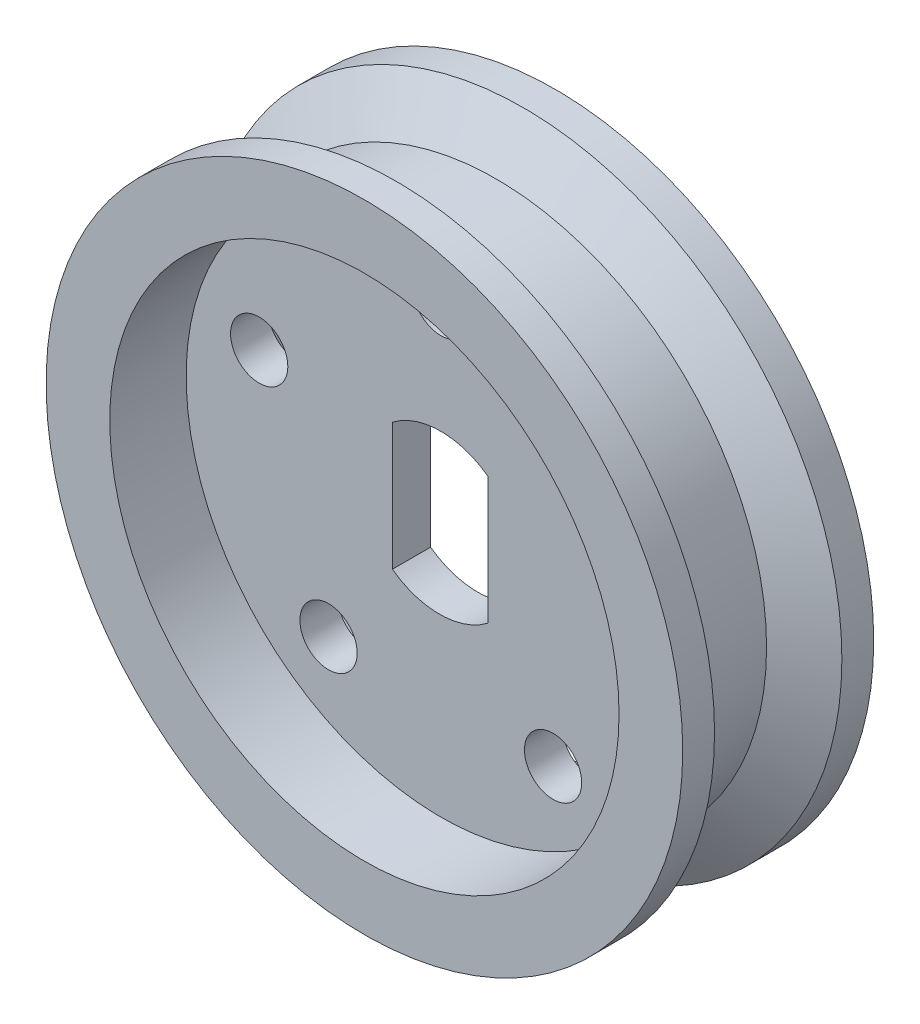
ISO-10303-21;
HEADER;
FILE_DESCRIPTION(('STEP AP214'),'2;1');
FILE_NAME('part.step','',(''),(''),'','','');
FILE_SCHEMA(('AUTOMOTIVE_DESIGN { 1 0 10303 214 1 1 1 1 }'));
ENDSEC;
DATA;
#1=APPLICATION_CONTEXT('core data for automotive mechanical design processes');
#2=APPLICATION_PROTOCOL_DEFINITION('international standard','automotive_design',2000,#1);
#3=PRODUCT_CONTEXT('',#1,'mechanical');
#4=PRODUCT('Part','Part','',(#3));
#5=PRODUCT_RELATED_PRODUCT_CATEGORY('part','',(#4));
#6=PRODUCT_DEFINITION_FORMATION('','',#4);
#7=PRODUCT_DEFINITION_CONTEXT('part definition',#1,'design');
#8=PRODUCT_DEFINITION('design','',#6,#7);
#9=PRODUCT_DEFINITION_SHAPE('','',#8);
#10=(LENGTH_UNIT() NAMED_UNIT(*) SI_UNIT(.MILLI.,.METRE.));
#11=(NAMED_UNIT(*) PLANE_ANGLE_UNIT() SI_UNIT($,.RADIAN.));
#12=(NAMED_UNIT(*) SI_UNIT($,.STERADIAN.) SOLID_ANGLE_UNIT());
#13=UNCERTAINTY_MEASURE_WITH_UNIT(LENGTH_MEASURE(1.E-05),#10,'distance_accuracy_value','');
#14=(GEOMETRIC_REPRESENTATION_CONTEXT(3) GLOBAL_UNCERTAINTY_ASSIGNED_CONTEXT((#13)) GLOBAL_UNIT_ASSIGNED_CONTEXT((#10,
#11,#12)) REPRESENTATION_CONTEXT('',''));
#15=CARTESIAN_POINT('',(0.,0.,0.));
#16=DIRECTION('',(0.,0.,1.));
#17=DIRECTION('',(1.,0.,0.));
#18=AXIS2_PLACEMENT_3D('',#15,#16,#17);
#19=CARTESIAN_POINT('',(0.,0.,3.));
#20=DIRECTION('',(0.,0.,-1.));
#21=DIRECTION('',(-1.,0.,0.));
#22=AXIS2_PLACEMENT_3D('',#19,#20,#21);
#23=CYLINDRICAL_SURFACE('',#22,10.);
#24=CARTESIAN_POINT('',(0.,0.,-3.));
#25=DIRECTION('',(0.,0.,1.));
#26=DIRECTION('',(1.,0.,0.));
#27=AXIS2_PLACEMENT_3D('',#24,#25,#26);
#28=CIRCLE('',#27,10.);
#29=CARTESIAN_POINT('',(10.,0.,-3.));
#30=VERTEX_POINT('',#29);
#31=EDGE_CURVE('E115',#30,#30,#28,.T.);
#32=ORIENTED_EDGE('',*,*,#31,.T.);
#33=EDGE_LOOP('',(#32));
#34=FACE_BOUND('',#33,.T.);
#35=CARTESIAN_POINT('',(0.,0.,-2.));
#36=DIRECTION('',(0.,0.,1.));
#37=DIRECTION('',(1.,0.,0.));
#38=AXIS2_PLACEMENT_3D('',#35,#36,#37);
#39=CIRCLE('',#38,10.);
#40=CARTESIAN_POINT('',(10.,0.,-2.));
#41=VERTEX_POINT('',#40);
#42=EDGE_CURVE('E163',#41,#41,#39,.T.);
#43=ORIENTED_EDGE('',*,*,#42,.F.);
#44=EDGE_LOOP('',(#43));
#45=FACE_BOUND('',#44,.T.);
#46=ADVANCED_FACE('F39',(#34,#45),#23,.T.);
#47=CARTESIAN_POINT('',(0.,0.,3.));
#48=DIRECTION('',(0.,0.,1.));
#49=DIRECTION('',(1.,0.,0.));
#50=AXIS2_PLACEMENT_3D('',#47,#48,#49);
#51=CIRCLE('',#50,10.);
#52=CARTESIAN_POINT('',(10.,0.,3.));
#53=VERTEX_POINT('',#52);
#54=EDGE_CURVE('E116',#53,#53,#51,.T.);
#55=ORIENTED_EDGE('',*,*,#54,.F.);
#56=EDGE_LOOP('',(#55));
#57=FACE_BOUND('',#56,.T.);
#58=CARTESIAN_POINT('',(0.,0.,2.));
#59=DIRECTION('',(0.,0.,1.));
#60=DIRECTION('',(1.,0.,0.));
#61=AXIS2_PLACEMENT_3D('',#58,#59,#60);
#62=CIRCLE('',#61,10.);
#63=CARTESIAN_POINT('',(10.,0.,2.));
#64=VERTEX_POINT('',#63);
#65=EDGE_CURVE('E144',#64,#64,#62,.T.);
#66=ORIENTED_EDGE('',*,*,#65,.T.);
#67=EDGE_LOOP('',(#66));
#68=FACE_BOUND('',#67,.T.);
#69=ADVANCED_FACE('F217',(#57,#68),#23,.T.);
#70=CARTESIAN_POINT('',(-0.0433210245197385,-0.000234595775072503,3.));
#71=DIRECTION('',(0.,0.,-1.));
#72=DIRECTION('',(-1.,0.,0.));
#73=AXIS2_PLACEMENT_3D('',#70,#71,#72);
#74=CYLINDRICAL_SURFACE('',#73,2.5);
#75=DIRECTION('',(0.,0.,-1.));
#76=VECTOR('',#75,1.);
#77=CARTESIAN_POINT('',(1.47825151432448,-1.98387191369263,3.));
#78=LINE('',#77,#76);
#79=CARTESIAN_POINT('',(1.47825151432448,-1.98387191369263,0.6));
#80=VERTEX_POINT('',#79);
#81=CARTESIAN_POINT('',(1.47825151432448,-1.98387191369263,-0.6));
#82=VERTEX_POINT('',#81);
#83=EDGE_CURVE('E93',#80,#82,#78,.T.);
#84=ORIENTED_EDGE('',*,*,#83,.T.);
#85=CARTESIAN_POINT('',(-0.0433210245197385,-0.000234595775072503,-0.6));
#86=DIRECTION('',(0.,0.,-1.));
#87=DIRECTION('',(-1.,0.,0.));
#88=AXIS2_PLACEMENT_3D('',#85,#86,#87);
#89=CIRCLE('',#88,2.5);
#90=CARTESIAN_POINT('',(-1.52157253884421,-2.01636268208244,-0.6));
#91=VERTEX_POINT('',#90);
#92=EDGE_CURVE('E81',#82,#91,#89,.T.);
#93=ORIENTED_EDGE('',*,*,#92,.T.);
#94=DIRECTION('',(0.,0.,-1.));
#95=VECTOR('',#94,1.);
#96=CARTESIAN_POINT('',(-1.52157253884421,-2.01636268208244,3.));
#97=LINE('',#96,#95);
#98=CARTESIAN_POINT('',(-1.52157253884421,-2.01636268208244,0.6));
#99=VERTEX_POINT('',#98);
#100=EDGE_CURVE('E91',#99,#91,#97,.T.);
#101=ORIENTED_EDGE('',*,*,#100,.F.);
#102=CARTESIAN_POINT('',(-0.0433210245197385,-0.000234595775072503,0.6));
#103=DIRECTION('',(0.,0.,1.));
#104=DIRECTION('',(1.,0.,0.));
#105=AXIS2_PLACEMENT_3D('',#102,#103,#104);
#106=CIRCLE('',#105,2.5);
#107=EDGE_CURVE('E63',#99,#80,#106,.T.);
#108=ORIENTED_EDGE('',*,*,#107,.T.);
#109=EDGE_LOOP('',(#84,#93,#101,#108));
#110=FACE_BOUND('',#109,.T.);
#111=ADVANCED_FACE('F90',(#110),#74,.F.);
#112=CARTESIAN_POINT('',(1.47825151432448,2.01612808630737,3.));
#113=DIRECTION('',(-1.,0.,0.));
#114=DIRECTION('',(0.,-1.,0.));
#115=AXIS2_PLACEMENT_3D('',#112,#113,#114);
#116=PLANE('',#115);
#117=DIRECTION('',(0.,0.,-1.));
#118=VECTOR('',#117,1.);
#119=CARTESIAN_POINT('',(1.47825151432448,2.01612808630737,3.));
#120=LINE('',#119,#118);
#121=CARTESIAN_POINT('',(1.47825151432448,2.01612808630737,0.6));
#122=VERTEX_POINT('',#121);
#123=CARTESIAN_POINT('',(1.47825151432448,2.01612808630737,-0.6));
#124=VERTEX_POINT('',#123);
#125=EDGE_CURVE('E104',#122,#124,#120,.T.);
#126=ORIENTED_EDGE('',*,*,#125,.T.);
#127=DIRECTION('',(0.,-1.,0.));
#128=VECTOR('',#127,1.);
#129=CARTESIAN_POINT('',(1.47825151432448,2.01612808630737,-0.6));
#130=LINE('',#129,#128);
#131=EDGE_CURVE('E96',#124,#82,#130,.T.);
#132=ORIENTED_EDGE('',*,*,#131,.T.);
#133=ORIENTED_EDGE('',*,*,#83,.F.);
#134=DIRECTION('',(0.,1.,0.));
#135=VECTOR('',#134,1.);
#136=CARTESIAN_POINT('',(1.47825151432448,2.01612808630737,0.6));
#137=LINE('',#136,#135);
#138=EDGE_CURVE('E106',#80,#122,#137,.T.);
#139=ORIENTED_EDGE('',*,*,#138,.T.);
#140=EDGE_LOOP('',(#126,#132,#133,#139));
#141=FACE_BOUND('',#140,.T.);
#142=ADVANCED_FACE('F193',(#141),#116,.T.);
#143=CARTESIAN_POINT('',(0.,0.,3.));
#144=DIRECTION('',(0.,0.,-1.));
#145=DIRECTION('',(-1.,0.,0.));
#146=AXIS2_PLACEMENT_3D('',#143,#144,#145);
#147=CYLINDRICAL_SURFACE('',#146,2.5);
#148=DIRECTION('',(0.,0.,-1.));
#149=VECTOR('',#148,1.);
#150=CARTESIAN_POINT('',(-1.52157253884421,1.98363731791756,3.));
#151=LINE('',#150,#149);
#152=CARTESIAN_POINT('',(-1.52157253884421,1.98363731791756,0.6));
#153=VERTEX_POINT('',#152);
#154=CARTESIAN_POINT('',(-1.52157253884421,1.98363731791756,-0.6));
#155=VERTEX_POINT('',#154);
#156=EDGE_CURVE('E100',#153,#155,#151,.T.);
#157=ORIENTED_EDGE('',*,*,#156,.T.);
#158=CARTESIAN_POINT('',(0.,0.,-0.6));
#159=DIRECTION('',(0.,0.,-1.));
#160=DIRECTION('',(-1.,0.,0.));
#161=AXIS2_PLACEMENT_3D('',#158,#159,#160);
#162=CIRCLE('',#161,2.5);
#163=EDGE_CURVE('E56',#155,#124,#162,.T.);
#164=ORIENTED_EDGE('',*,*,#163,.T.);
#165=ORIENTED_EDGE('',*,*,#125,.F.);
#166=CARTESIAN_POINT('',(0.,0.,0.6));
#167=DIRECTION('',(0.,0.,1.));
#168=DIRECTION('',(1.,0.,0.));
#169=AXIS2_PLACEMENT_3D('',#166,#167,#168);
#170=CIRCLE('',#169,2.5);
#171=EDGE_CURVE('E183',#122,#153,#170,.T.);
#172=ORIENTED_EDGE('',*,*,#171,.T.);
#173=EDGE_LOOP('',(#157,#164,#165,#172));
#174=FACE_BOUND('',#173,.T.);
#175=ADVANCED_FACE('F195',(#174),#147,.F.);
#176=CARTESIAN_POINT('',(-1.52157253884421,1.98363731791756,3.));
#177=DIRECTION('',(1.,0.,0.));
#178=DIRECTION('',(0.,1.,0.));
#179=AXIS2_PLACEMENT_3D('',#176,#177,#178);
#180=PLANE('',#179);
#181=ORIENTED_EDGE('',*,*,#100,.T.);
#182=DIRECTION('',(0.,1.,0.));
#183=VECTOR('',#182,1.);
#184=CARTESIAN_POINT('',(-1.52157253884421,1.98363731791756,-0.6));
#185=LINE('',#184,#183);
#186=EDGE_CURVE('E11',#91,#155,#185,.T.);
#187=ORIENTED_EDGE('',*,*,#186,.T.);
#188=ORIENTED_EDGE('',*,*,#156,.F.);
#189=DIRECTION('',(0.,-1.,0.));
#190=VECTOR('',#189,1.);
#191=CARTESIAN_POINT('',(-1.52157253884421,1.98363731791756,0.6));
#192=LINE('',#191,#190);
#193=EDGE_CURVE('E48',#153,#99,#192,.T.);
#194=ORIENTED_EDGE('',*,*,#193,.T.);
#195=EDGE_LOOP('',(#181,#187,#188,#194));
#196=FACE_BOUND('',#195,.T.);
#197=ADVANCED_FACE('F98',(#196),#180,.T.);
#198=CARTESIAN_POINT('',(0.,0.,3.));
#199=DIRECTION('',(0.,0.,1.));
#200=DIRECTION('',(1.,0.,0.));
#201=AXIS2_PLACEMENT_3D('',#198,#199,#200);
#202=PLANE('',#201);
#203=CARTESIAN_POINT('',(0.,0.,3.));
#204=DIRECTION('',(0.,0.,1.));
#205=DIRECTION('',(1.,0.,0.));
#206=AXIS2_PLACEMENT_3D('',#203,#204,#205);
#207=CIRCLE('',#206,8.);
#208=CARTESIAN_POINT('',(8.,0.,3.));
#209=VERTEX_POINT('',#208);
#210=EDGE_CURVE('E95',#209,#209,#207,.T.);
#211=ORIENTED_EDGE('',*,*,#210,.F.);
#212=EDGE_LOOP('',(#211));
#213=FACE_BOUND('',#212,.T.);
#214=ORIENTED_EDGE('',*,*,#54,.T.);
#215=EDGE_LOOP('',(#214));
#216=FACE_BOUND('',#215,.T.);
#217=ADVANCED_FACE('F211',(#213,#216),#202,.T.);
#218=CARTESIAN_POINT('',(0.,0.,-3.));
#219=DIRECTION('',(0.,0.,1.));
#220=DIRECTION('',(1.,0.,0.));
#221=AXIS2_PLACEMENT_3D('',#218,#219,#220);
#222=PLANE('',#221);
#223=CARTESIAN_POINT('',(0.,0.,-3.));
#224=DIRECTION('',(0.,0.,1.));
#225=DIRECTION('',(1.,0.,0.));
#226=AXIS2_PLACEMENT_3D('',#223,#224,#225);
#227=CIRCLE('',#226,8.);
#228=CARTESIAN_POINT('',(8.,0.,-3.));
#229=VERTEX_POINT('',#228);
#230=EDGE_CURVE('E167',#229,#229,#227,.T.);
#231=ORIENTED_EDGE('',*,*,#230,.T.);
#232=EDGE_LOOP('',(#231));
#233=FACE_BOUND('',#232,.T.);
#234=ORIENTED_EDGE('',*,*,#31,.F.);
#235=EDGE_LOOP('',(#234));
#236=FACE_BOUND('',#235,.T.);
#237=ADVANCED_FACE('F207',(#233,#236),#222,.F.);
#238=CARTESIAN_POINT('',(0.,0.,0.6));
#239=DIRECTION('',(0.,0.,1.));
#240=DIRECTION('',(1.,0.,0.));
#241=AXIS2_PLACEMENT_3D('',#238,#239,#240);
#242=CYLINDRICAL_SURFACE('',#241,8.);
#243=CARTESIAN_POINT('',(0.,0.,0.6));
#244=DIRECTION('',(0.,0.,1.));
#245=DIRECTION('',(1.,0.,0.));
#246=AXIS2_PLACEMENT_3D('',#243,#244,#245);
#247=CIRCLE('',#246,8.);
#248=CARTESIAN_POINT('',(8.,0.,0.6));
#249=VERTEX_POINT('',#248);
#250=EDGE_CURVE('E179',#249,#249,#247,.T.);
#251=ORIENTED_EDGE('',*,*,#250,.F.);
#252=EDGE_LOOP('',(#251));
#253=FACE_BOUND('',#252,.T.);
#254=ORIENTED_EDGE('',*,*,#210,.T.);
#255=EDGE_LOOP('',(#254));
#256=FACE_BOUND('',#255,.T.);
#257=ADVANCED_FACE('F200',(#253,#256),#242,.F.);
#258=CARTESIAN_POINT('',(0.,0.,0.6));
#259=DIRECTION('',(0.,0.,1.));
#260=DIRECTION('',(1.,0.,0.));
#261=AXIS2_PLACEMENT_3D('',#258,#259,#260);
#262=PLANE('',#261);
#263=CARTESIAN_POINT('',(0.,6.,0.6));
#264=DIRECTION('',(0.,0.,1.));
#265=DIRECTION('',(1.,0.,0.));
#266=AXIS2_PLACEMENT_3D('',#263,#264,#265);
#267=CIRCLE('',#266,0.9);
#268=CARTESIAN_POINT('',(0.9,6.,0.6));
#269=VERTEX_POINT('',#268);
#270=EDGE_CURVE('E355',#269,#269,#267,.T.);
#271=ORIENTED_EDGE('',*,*,#270,.F.);
#272=EDGE_LOOP('',(#271));
#273=FACE_BOUND('',#272,.T.);
#274=CARTESIAN_POINT('',(5.7063390977711,1.85410196624993,0.6));
#275=DIRECTION('',(0.,0.,1.));
#276=DIRECTION('',(1.,0.,0.));
#277=AXIS2_PLACEMENT_3D('',#274,#275,#276);
#278=CIRCLE('',#277,0.900000000000115);
#279=CARTESIAN_POINT('',(6.60633909777121,1.85410196624993,0.6));
#280=VERTEX_POINT('',#279);
#281=EDGE_CURVE('E357',#280,#280,#278,.T.);
#282=ORIENTED_EDGE('',*,*,#281,.F.);
#283=EDGE_LOOP('',(#282));
#284=FACE_BOUND('',#283,.T.);
#285=CARTESIAN_POINT('',(3.5267115137553,-4.85410196624953,0.6));
#286=DIRECTION('',(0.,0.,1.));
#287=DIRECTION('',(1.,0.,0.));
#288=AXIS2_PLACEMENT_3D('',#285,#286,#287);
#289=CIRCLE('',#288,0.900000000000429);
#290=CARTESIAN_POINT('',(4.42671151375573,-4.85410196624953,0.6));
#291=VERTEX_POINT('',#290);
#292=EDGE_CURVE('E363',#291,#291,#289,.T.);
#293=ORIENTED_EDGE('',*,*,#292,.F.);
#294=EDGE_LOOP('',(#293));
#295=FACE_BOUND('',#294,.T.);
#296=CARTESIAN_POINT('',(-5.70633909777075,1.85410196624944,0.6));
#297=DIRECTION('',(0.,0.,1.));
#298=DIRECTION('',(1.,0.,0.));
#299=AXIS2_PLACEMENT_3D('',#296,#297,#298);
#300=CIRCLE('',#299,0.900000000000304);
#301=CARTESIAN_POINT('',(-4.80633909777044,1.85410196624944,0.6));
#302=VERTEX_POINT('',#301);
#303=EDGE_CURVE('E365',#302,#302,#300,.T.);
#304=ORIENTED_EDGE('',*,*,#303,.F.);
#305=EDGE_LOOP('',(#304));
#306=FACE_BOUND('',#305,.T.);
#307=CARTESIAN_POINT('',(-3.52671151375438,-4.85410196624983,0.6));
#308=DIRECTION('',(0.,0.,1.));
#309=DIRECTION('',(1.,0.,0.));
#310=AXIS2_PLACEMENT_3D('',#307,#308,#309);
#311=CIRCLE('',#310,0.900000000000534);
#312=CARTESIAN_POINT('',(-2.62671151375385,-4.85410196624983,0.6));
#313=VERTEX_POINT('',#312);
#314=EDGE_CURVE('E130',#313,#313,#311,.T.);
#315=ORIENTED_EDGE('',*,*,#314,.F.);
#316=EDGE_LOOP('',(#315));
#317=FACE_BOUND('',#316,.T.);
#318=ORIENTED_EDGE('',*,*,#193,.F.);
#319=ORIENTED_EDGE('',*,*,#171,.F.);
#320=ORIENTED_EDGE('',*,*,#138,.F.);
#321=ORIENTED_EDGE('',*,*,#107,.F.);
#322=EDGE_LOOP('',(#318,#319,#320,#321));
#323=FACE_BOUND('',#322,.T.);
#324=ORIENTED_EDGE('',*,*,#250,.T.);
#325=EDGE_LOOP('',(#324));
#326=FACE_BOUND('',#325,.T.);
#327=ADVANCED_FACE('F196',(#273,#284,#295,#306,#317,#323,#326),#262,.T.);
#328=CARTESIAN_POINT('',(0.,0.,-0.6));
#329=DIRECTION('',(0.,0.,-1.));
#330=DIRECTION('',(-1.,0.,0.));
#331=AXIS2_PLACEMENT_3D('',#328,#329,#330);
#332=CYLINDRICAL_SURFACE('',#331,8.);
#333=CARTESIAN_POINT('',(0.,0.,-0.6));
#334=DIRECTION('',(0.,0.,1.));
#335=DIRECTION('',(1.,0.,0.));
#336=AXIS2_PLACEMENT_3D('',#333,#334,#335);
#337=CIRCLE('',#336,8.);
#338=CARTESIAN_POINT('',(8.,0.,-0.6));
#339=VERTEX_POINT('',#338);
#340=EDGE_CURVE('E168',#339,#339,#337,.T.);
#341=ORIENTED_EDGE('',*,*,#340,.T.);
#342=EDGE_LOOP('',(#341));
#343=FACE_BOUND('',#342,.T.);
#344=ORIENTED_EDGE('',*,*,#230,.F.);
#345=EDGE_LOOP('',(#344));
#346=FACE_BOUND('',#345,.T.);
#347=ADVANCED_FACE('F199',(#343,#346),#332,.F.);
#348=CARTESIAN_POINT('',(0.,0.,-0.6));
#349=DIRECTION('',(0.,0.,-1.));
#350=DIRECTION('',(1.,0.,0.));
#351=AXIS2_PLACEMENT_3D('',#348,#349,#350);
#352=PLANE('',#351);
#353=CARTESIAN_POINT('',(0.,6.,-0.6));
#354=DIRECTION('',(0.,0.,-1.));
#355=DIRECTION('',(-1.,0.,0.));
#356=AXIS2_PLACEMENT_3D('',#353,#354,#355);
#357=CIRCLE('',#356,0.9);
#358=CARTESIAN_POINT('',(-0.9,6.,-0.6));
#359=VERTEX_POINT('',#358);
#360=EDGE_CURVE('E42',#359,#359,#357,.T.);
#361=ORIENTED_EDGE('',*,*,#360,.F.);
#362=EDGE_LOOP('',(#361));
#363=FACE_BOUND('',#362,.T.);
#364=CARTESIAN_POINT('',(5.7063390977711,1.85410196624993,-0.6));
#365=DIRECTION('',(0.,0.,-1.));
#366=DIRECTION('',(-1.,0.,0.));
#367=AXIS2_PLACEMENT_3D('',#364,#365,#366);
#368=CIRCLE('',#367,0.900000000000115);
#369=CARTESIAN_POINT('',(4.80633909777098,1.85410196624993,-0.6));
#370=VERTEX_POINT('',#369);
#371=EDGE_CURVE('E137',#370,#370,#368,.T.);
#372=ORIENTED_EDGE('',*,*,#371,.F.);
#373=EDGE_LOOP('',(#372));
#374=FACE_BOUND('',#373,.T.);
#375=CARTESIAN_POINT('',(3.5267115137553,-4.85410196624953,-0.6));
#376=DIRECTION('',(0.,0.,-1.));
#377=DIRECTION('',(-1.,0.,0.));
#378=AXIS2_PLACEMENT_3D('',#375,#376,#377);
#379=CIRCLE('',#378,0.900000000000429);
#380=CARTESIAN_POINT('',(2.62671151375487,-4.85410196624953,-0.6));
#381=VERTEX_POINT('',#380);
#382=EDGE_CURVE('E134',#381,#381,#379,.T.);
#383=ORIENTED_EDGE('',*,*,#382,.F.);
#384=EDGE_LOOP('',(#383));
#385=FACE_BOUND('',#384,.T.);
#386=CARTESIAN_POINT('',(-5.70633909777075,1.85410196624944,-0.6));
#387=DIRECTION('',(0.,0.,-1.));
#388=DIRECTION('',(-1.,0.,0.));
#389=AXIS2_PLACEMENT_3D('',#386,#387,#388);
#390=CIRCLE('',#389,0.900000000000304);
#391=CARTESIAN_POINT('',(-6.60633909777105,1.85410196624944,-0.6));
#392=VERTEX_POINT('',#391);
#393=EDGE_CURVE('E129',#392,#392,#390,.T.);
#394=ORIENTED_EDGE('',*,*,#393,.F.);
#395=EDGE_LOOP('',(#394));
#396=FACE_BOUND('',#395,.T.);
#397=CARTESIAN_POINT('',(-3.52671151375438,-4.85410196624983,-0.6));
#398=DIRECTION('',(0.,0.,-1.));
#399=DIRECTION('',(-1.,0.,0.));
#400=AXIS2_PLACEMENT_3D('',#397,#398,#399);
#401=CIRCLE('',#400,0.900000000000534);
#402=CARTESIAN_POINT('',(-4.42671151375491,-4.85410196624983,-0.6));
#403=VERTEX_POINT('',#402);
#404=EDGE_CURVE('E125',#403,#403,#401,.T.);
#405=ORIENTED_EDGE('',*,*,#404,.F.);
#406=EDGE_LOOP('',(#405));
#407=FACE_BOUND('',#406,.T.);
#408=ORIENTED_EDGE('',*,*,#131,.F.);
#409=ORIENTED_EDGE('',*,*,#163,.F.);
#410=ORIENTED_EDGE('',*,*,#186,.F.);
#411=ORIENTED_EDGE('',*,*,#92,.F.);
#412=EDGE_LOOP('',(#408,#409,#410,#411));
#413=FACE_BOUND('',#412,.T.);
#414=ORIENTED_EDGE('',*,*,#340,.F.);
#415=EDGE_LOOP('',(#414));
#416=FACE_BOUND('',#415,.T.);
#417=ADVANCED_FACE('F79',(#363,#374,#385,#396,#407,#413,#416),#352,.T.);
#418=CARTESIAN_POINT('',(0.,0.,-1.13397459621555));
#419=DIRECTION('',(0.,0.,-1.));
#420=DIRECTION('',(-1.,0.,0.));
#421=AXIS2_PLACEMENT_3D('',#418,#419,#420);
#422=CONICAL_SURFACE('',#421,8.5,1.04719755119659);
#423=ORIENTED_EDGE('',*,*,#42,.T.);
#424=EDGE_LOOP('',(#423));
#425=FACE_BOUND('',#424,.T.);
#426=CARTESIAN_POINT('',(0.,0.,-1.13397459621555));
#427=DIRECTION('',(0.,0.,1.));
#428=DIRECTION('',(1.,0.,0.));
#429=AXIS2_PLACEMENT_3D('',#426,#427,#428);
#430=CIRCLE('',#429,8.5);
#431=CARTESIAN_POINT('',(8.5,0.,-1.13397459621555));
#432=VERTEX_POINT('',#431);
#433=EDGE_CURVE('E155',#432,#432,#430,.T.);
#434=ORIENTED_EDGE('',*,*,#433,.F.);
#435=EDGE_LOOP('',(#434));
#436=FACE_BOUND('',#435,.T.);
#437=ADVANCED_FACE('F231',(#425,#436),#422,.T.);
#438=CARTESIAN_POINT('',(0.,0.,0.));
#439=DIRECTION('',(0.,0.,1.));
#440=DIRECTION('',(1.,0.,0.));
#441=AXIS2_PLACEMENT_3D('',#438,#439,#440);
#442=CYLINDRICAL_SURFACE('',#441,8.5);
#443=ORIENTED_EDGE('',*,*,#433,.T.);
#444=EDGE_LOOP('',(#443));
#445=FACE_BOUND('',#444,.T.);
#446=CARTESIAN_POINT('',(0.,0.,1.13397459621555));
#447=DIRECTION('',(0.,0.,1.));
#448=DIRECTION('',(1.,0.,0.));
#449=AXIS2_PLACEMENT_3D('',#446,#447,#448);
#450=CIRCLE('',#449,8.5);
#451=CARTESIAN_POINT('',(8.5,0.,1.13397459621555));
#452=VERTEX_POINT('',#451);
#453=EDGE_CURVE('E149',#452,#452,#450,.T.);
#454=ORIENTED_EDGE('',*,*,#453,.F.);
#455=EDGE_LOOP('',(#454));
#456=FACE_BOUND('',#455,.T.);
#457=ADVANCED_FACE('F234',(#445,#456),#442,.T.);
#458=CARTESIAN_POINT('',(0.,0.,2.));
#459=DIRECTION('',(0.,0.,1.));
#460=DIRECTION('',(1.,0.,0.));
#461=AXIS2_PLACEMENT_3D('',#458,#459,#460);
#462=CONICAL_SURFACE('',#461,10.,1.04719755119659);
#463=ORIENTED_EDGE('',*,*,#453,.T.);
#464=EDGE_LOOP('',(#463));
#465=FACE_BOUND('',#464,.T.);
#466=ORIENTED_EDGE('',*,*,#65,.F.);
#467=EDGE_LOOP('',(#466));
#468=FACE_BOUND('',#467,.T.);
#469=ADVANCED_FACE('F240',(#465,#468),#462,.T.);
#470=CARTESIAN_POINT('',(-3.52671151375438,-4.85410196624983,-3.));
#471=DIRECTION('',(0.,0.,1.));
#472=DIRECTION('',(1.,0.,0.));
#473=AXIS2_PLACEMENT_3D('',#470,#471,#472);
#474=CYLINDRICAL_SURFACE('',#473,0.900000000000534);
#475=ORIENTED_EDGE('',*,*,#404,.T.);
#476=EDGE_LOOP('',(#475));
#477=FACE_BOUND('',#476,.T.);
#478=ORIENTED_EDGE('',*,*,#314,.T.);
#479=EDGE_LOOP('',(#478));
#480=FACE_BOUND('',#479,.T.);
#481=ADVANCED_FACE('F246',(#477,#480),#474,.F.);
#482=CARTESIAN_POINT('',(-5.70633909777075,1.85410196624944,-3.));
#483=DIRECTION('',(0.,0.,1.));
#484=DIRECTION('',(1.,0.,0.));
#485=AXIS2_PLACEMENT_3D('',#482,#483,#484);
#486=CYLINDRICAL_SURFACE('',#485,0.900000000000304);
#487=ORIENTED_EDGE('',*,*,#393,.T.);
#488=EDGE_LOOP('',(#487));
#489=FACE_BOUND('',#488,.T.);
#490=ORIENTED_EDGE('',*,*,#303,.T.);
#491=EDGE_LOOP('',(#490));
#492=FACE_BOUND('',#491,.T.);
#493=ADVANCED_FACE('F251',(#489,#492),#486,.F.);
#494=CARTESIAN_POINT('',(3.5267115137553,-4.85410196624953,-3.));
#495=DIRECTION('',(0.,0.,1.));
#496=DIRECTION('',(1.,0.,0.));
#497=AXIS2_PLACEMENT_3D('',#494,#495,#496);
#498=CYLINDRICAL_SURFACE('',#497,0.900000000000429);
#499=ORIENTED_EDGE('',*,*,#382,.T.);
#500=EDGE_LOOP('',(#499));
#501=FACE_BOUND('',#500,.T.);
#502=ORIENTED_EDGE('',*,*,#292,.T.);
#503=EDGE_LOOP('',(#502));
#504=FACE_BOUND('',#503,.T.);
#505=ADVANCED_FACE('F321',(#501,#504),#498,.F.);
#506=CARTESIAN_POINT('',(5.7063390977711,1.85410196624993,-3.));
#507=DIRECTION('',(0.,0.,1.));
#508=DIRECTION('',(1.,0.,0.));
#509=AXIS2_PLACEMENT_3D('',#506,#507,#508);
#510=CYLINDRICAL_SURFACE('',#509,0.900000000000115);
#511=ORIENTED_EDGE('',*,*,#371,.T.);
#512=EDGE_LOOP('',(#511));
#513=FACE_BOUND('',#512,.T.);
#514=ORIENTED_EDGE('',*,*,#281,.T.);
#515=EDGE_LOOP('',(#514));
#516=FACE_BOUND('',#515,.T.);
#517=ADVANCED_FACE('F330',(#513,#516),#510,.F.);
#518=CARTESIAN_POINT('',(0.,6.,-3.));
#519=DIRECTION('',(0.,0.,1.));
#520=DIRECTION('',(1.,0.,0.));
#521=AXIS2_PLACEMENT_3D('',#518,#519,#520);
#522=CYLINDRICAL_SURFACE('',#521,0.9);
#523=ORIENTED_EDGE('',*,*,#360,.T.);
#524=EDGE_LOOP('',(#523));
#525=FACE_BOUND('',#524,.T.);
#526=ORIENTED_EDGE('',*,*,#270,.T.);
#527=EDGE_LOOP('',(#526));
#528=FACE_BOUND('',#527,.T.);
#529=ADVANCED_FACE('F339',(#525,#528),#522,.F.);
#530=CLOSED_SHELL('',(#46,#69,#111,#142,#175,#197,#217,#237,#257,#327,#347,#417,#437,#457,#469,
#481,#493,#505,#517,#529));
#531=MANIFOLD_SOLID_BREP('B2',#530);
#532=ADVANCED_BREP_SHAPE_REPRESENTATION('',(#18,#531),#14);
#533=SHAPE_DEFINITION_REPRESENTATION(#9,#532);
ENDSEC;
END-ISO-10303-21;
